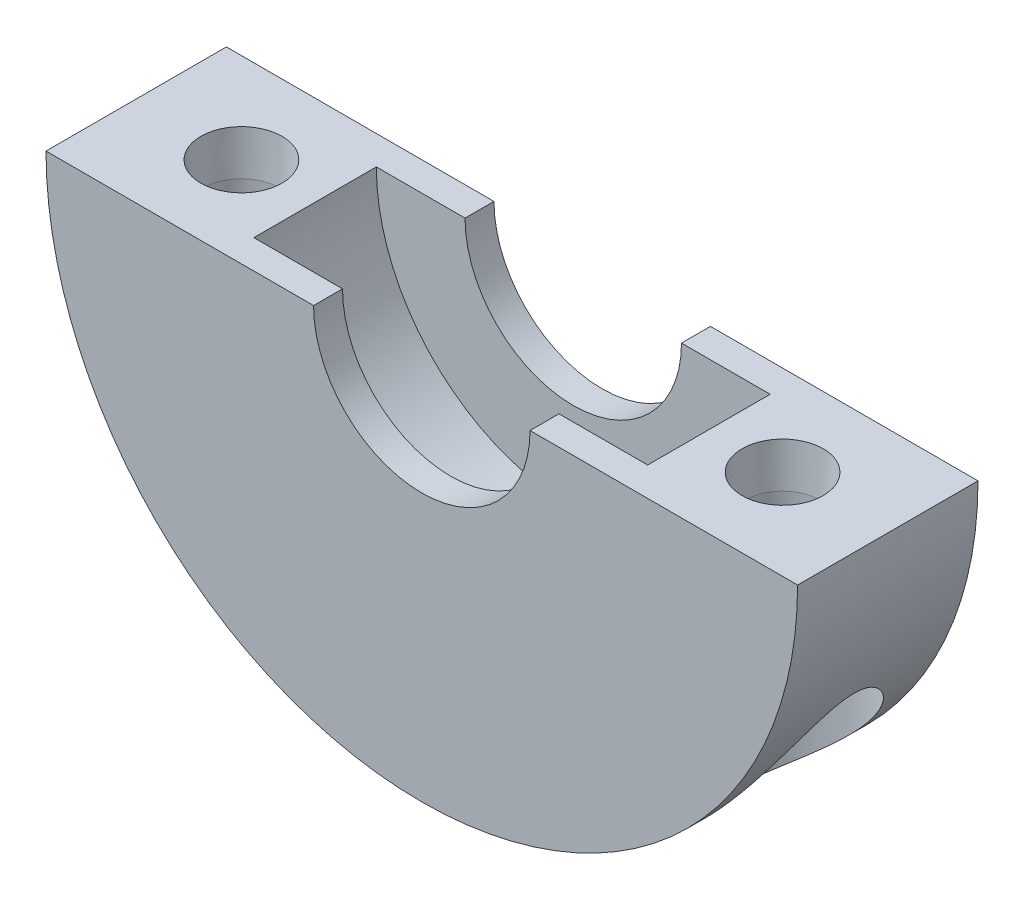
ISO-10303-21;
HEADER;
FILE_DESCRIPTION(('STEP AP214'),'2;1');
FILE_NAME('part.step','',(''),(''),'','','');
FILE_SCHEMA(('AUTOMOTIVE_DESIGN { 1 0 10303 214 1 1 1 1 }'));
ENDSEC;
DATA;
#1=APPLICATION_CONTEXT('core data for automotive mechanical design processes');
#2=APPLICATION_PROTOCOL_DEFINITION('international standard','automotive_design',2000,#1);
#3=PRODUCT_CONTEXT('',#1,'mechanical');
#4=PRODUCT('Part','Part','',(#3));
#5=PRODUCT_RELATED_PRODUCT_CATEGORY('part','',(#4));
#6=PRODUCT_DEFINITION_FORMATION('','',#4);
#7=PRODUCT_DEFINITION_CONTEXT('part definition',#1,'design');
#8=PRODUCT_DEFINITION('design','',#6,#7);
#9=PRODUCT_DEFINITION_SHAPE('','',#8);
#10=(LENGTH_UNIT() NAMED_UNIT(*) SI_UNIT(.MILLI.,.METRE.));
#11=(NAMED_UNIT(*) PLANE_ANGLE_UNIT() SI_UNIT($,.RADIAN.));
#12=(NAMED_UNIT(*) SI_UNIT($,.STERADIAN.) SOLID_ANGLE_UNIT());
#13=UNCERTAINTY_MEASURE_WITH_UNIT(LENGTH_MEASURE(1.E-05),#10,'distance_accuracy_value','');
#14=(GEOMETRIC_REPRESENTATION_CONTEXT(3) GLOBAL_UNCERTAINTY_ASSIGNED_CONTEXT((#13)) GLOBAL_UNIT_ASSIGNED_CONTEXT((#10,
#11,#12)) REPRESENTATION_CONTEXT('',''));
#15=CARTESIAN_POINT('',(0.,0.,0.));
#16=DIRECTION('',(0.,0.,1.));
#17=DIRECTION('',(1.,0.,0.));
#18=AXIS2_PLACEMENT_3D('',#15,#16,#17);
#19=CARTESIAN_POINT('',(0.,0.,12.));
#20=DIRECTION('',(0.,1.,0.));
#21=DIRECTION('',(-1.,0.,0.));
#22=AXIS2_PLACEMENT_3D('',#19,#20,#21);
#23=PLANE('',#22);
#24=CARTESIAN_POINT('',(18.,0.,6.));
#25=DIRECTION('',(0.,1.,0.));
#26=DIRECTION('',(0.,0.,1.));
#27=AXIS2_PLACEMENT_3D('',#24,#25,#26);
#28=CIRCLE('',#27,2.7);
#29=CARTESIAN_POINT('',(18.,0.,8.7));
#30=VERTEX_POINT('',#29);
#31=EDGE_CURVE('E229',#30,#30,#28,.T.);
#32=ORIENTED_EDGE('',*,*,#31,.F.);
#33=EDGE_LOOP('',(#32));
#34=FACE_BOUND('',#33,.T.);
#35=DIRECTION('',(0.,0.,-1.));
#36=VECTOR('',#35,1.);
#37=CARTESIAN_POINT('',(7.2,0.,0.));
#38=LINE('',#37,#36);
#39=CARTESIAN_POINT('',(7.2,0.,1.925));
#40=VERTEX_POINT('',#39);
#41=CARTESIAN_POINT('',(7.2,0.,0.));
#42=VERTEX_POINT('',#41);
#43=EDGE_CURVE('E51',#40,#42,#38,.T.);
#44=ORIENTED_EDGE('',*,*,#43,.F.);
#45=DIRECTION('',(-1.,0.,0.));
#46=VECTOR('',#45,1.);
#47=CARTESIAN_POINT('',(0.,0.,1.925));
#48=LINE('',#47,#46);
#49=CARTESIAN_POINT('',(13.1,0.,1.925));
#50=VERTEX_POINT('',#49);
#51=EDGE_CURVE('E11',#50,#40,#48,.T.);
#52=ORIENTED_EDGE('',*,*,#51,.F.);
#53=DIRECTION('',(0.,0.,-1.));
#54=VECTOR('',#53,1.);
#55=CARTESIAN_POINT('',(13.1,0.,0.));
#56=LINE('',#55,#54);
#57=CARTESIAN_POINT('',(13.1,0.,10.075));
#58=VERTEX_POINT('',#57);
#59=EDGE_CURVE('E42',#58,#50,#56,.T.);
#60=ORIENTED_EDGE('',*,*,#59,.F.);
#61=DIRECTION('',(-1.,0.,0.));
#62=VECTOR('',#61,1.);
#63=CARTESIAN_POINT('',(0.,0.,10.075));
#64=LINE('',#63,#62);
#65=CARTESIAN_POINT('',(7.2,0.,10.075));
#66=VERTEX_POINT('',#65);
#67=EDGE_CURVE('E212',#58,#66,#64,.T.);
#68=ORIENTED_EDGE('',*,*,#67,.T.);
#69=DIRECTION('',(0.,0.,-1.));
#70=VECTOR('',#69,1.);
#71=CARTESIAN_POINT('',(7.2,0.,0.));
#72=LINE('',#71,#70);
#73=CARTESIAN_POINT('',(7.2,0.,12.));
#74=VERTEX_POINT('',#73);
#75=EDGE_CURVE('E168',#74,#66,#72,.T.);
#76=ORIENTED_EDGE('',*,*,#75,.F.);
#77=DIRECTION('',(1.,0.,0.));
#78=VECTOR('',#77,1.);
#79=CARTESIAN_POINT('',(0.,0.,12.));
#80=LINE('',#79,#78);
#81=CARTESIAN_POINT('',(25.,0.,12.));
#82=VERTEX_POINT('',#81);
#83=EDGE_CURVE('E60',#74,#82,#80,.T.);
#84=ORIENTED_EDGE('',*,*,#83,.T.);
#85=DIRECTION('',(0.,0.,-1.));
#86=VECTOR('',#85,1.);
#87=CARTESIAN_POINT('',(25.,0.,12.));
#88=LINE('',#87,#86);
#89=CARTESIAN_POINT('',(25.,0.,0.));
#90=VERTEX_POINT('',#89);
#91=EDGE_CURVE('E85',#82,#90,#88,.T.);
#92=ORIENTED_EDGE('',*,*,#91,.T.);
#93=DIRECTION('',(1.,0.,0.));
#94=VECTOR('',#93,1.);
#95=CARTESIAN_POINT('',(0.,0.,0.));
#96=LINE('',#95,#94);
#97=EDGE_CURVE('E74',#42,#90,#96,.T.);
#98=ORIENTED_EDGE('',*,*,#97,.F.);
#99=EDGE_LOOP('',(#44,#52,#60,#68,#76,#84,#92,#98));
#100=FACE_BOUND('',#99,.T.);
#101=ADVANCED_FACE('F33',(#34,#100),#23,.T.);
#102=CARTESIAN_POINT('',(0.,0.,12.));
#103=DIRECTION('',(0.,0.,-1.));
#104=DIRECTION('',(-1.,0.,0.));
#105=AXIS2_PLACEMENT_3D('',#102,#103,#104);
#106=CYLINDRICAL_SURFACE('',#105,25.);
#107=CARTESIAN_POINT('',(0.,0.,0.));
#108=DIRECTION('',(0.,0.,1.));
#109=DIRECTION('',(1.,0.,0.));
#110=AXIS2_PLACEMENT_3D('',#107,#108,#109);
#111=CIRCLE('',#110,25.);
#112=CARTESIAN_POINT('',(-25.,0.,0.));
#113=VERTEX_POINT('',#112);
#114=EDGE_CURVE('E78',#113,#90,#111,.T.);
#115=ORIENTED_EDGE('',*,*,#114,.T.);
#116=ORIENTED_EDGE('',*,*,#91,.F.);
#117=CARTESIAN_POINT('',(0.,0.,12.));
#118=DIRECTION('',(0.,0.,1.));
#119=DIRECTION('',(1.,0.,0.));
#120=AXIS2_PLACEMENT_3D('',#117,#118,#119);
#121=CIRCLE('',#120,25.);
#122=CARTESIAN_POINT('',(-25.,0.,12.));
#123=VERTEX_POINT('',#122);
#124=EDGE_CURVE('E89',#123,#82,#121,.T.);
#125=ORIENTED_EDGE('',*,*,#124,.F.);
#126=DIRECTION('',(0.,0.,-1.));
#127=VECTOR('',#126,1.);
#128=CARTESIAN_POINT('',(-25.,0.,12.));
#129=LINE('',#128,#127);
#130=EDGE_CURVE('E88',#123,#113,#129,.T.);
#131=ORIENTED_EDGE('',*,*,#130,.T.);
#132=EDGE_LOOP('',(#115,#116,#125,#131));
#133=FACE_BOUND('',#132,.T.);
#134=CARTESIAN_POINT('',(-13.25,-21.1999410376539,6.));
#135=CARTESIAN_POINT('',(-13.2500009354019,-21.1999406878279,6.11699361126747));
#136=CARTESIAN_POINT('',(-13.254329216846,-21.1972371754924,6.23402318464072));
#137=CARTESIAN_POINT('',(-13.2715892849546,-21.1864347706166,6.46724693337123));
#138=CARTESIAN_POINT('',(-13.2845263192154,-21.1783325872301,6.58344055546743));
#139=CARTESIAN_POINT('',(-13.3188614661342,-21.156756385658,6.81430009601783));
#140=CARTESIAN_POINT('',(-13.3402758904643,-21.1432720109755,6.92896262614904));
#141=CARTESIAN_POINT('',(-13.3912818987238,-21.1110037272912,7.15573854865243));
#142=CARTESIAN_POINT('',(-13.4208767862804,-21.0922176771776,7.26785089130886));
#143=CARTESIAN_POINT('',(-13.4877234802794,-21.0495339680623,7.48831511482083));
#144=CARTESIAN_POINT('',(-13.5249476383107,-21.0256547542797,7.59667896758992));
#145=CARTESIAN_POINT('',(-13.6066522648071,-20.9728724424999,7.80941552965167));
#146=CARTESIAN_POINT('',(-13.6511354506462,-20.9439674628706,7.91378672618618));
#147=CARTESIAN_POINT('',(-13.7467560236759,-20.8813304174432,8.11780463726225));
#148=CARTESIAN_POINT('',(-13.7978875611386,-20.8476025925809,8.21745540125836));
#149=CARTESIAN_POINT('',(-13.9062526325002,-20.7754753346104,8.4116600733157));
#150=CARTESIAN_POINT('',(-13.963488487261,-20.737074123892,8.50621202208845));
#151=CARTESIAN_POINT('',(-14.0857997976982,-20.6541983185497,8.69342275965967));
#152=CARTESIAN_POINT('',(-14.1510963333156,-20.609543082356,8.78585720595197));
#153=CARTESIAN_POINT('',(-14.286863595557,-20.5156612952178,8.96440800309845));
#154=CARTESIAN_POINT('',(-14.3573361722325,-20.4664331081011,9.05052207268236));
#155=CARTESIAN_POINT('',(-14.5754125344253,-20.3122850329553,9.29896746350432));
#156=CARTESIAN_POINT('',(-14.7297410009443,-20.2008573709025,9.45150136157468));
#157=CARTESIAN_POINT('',(-15.0715415792244,-19.947420684545,9.74757458625588));
#158=CARTESIAN_POINT('',(-15.2607078111097,-19.8033178528879,9.8873229239578));
#159=CARTESIAN_POINT('',(-15.6477876780748,-19.4989073588987,10.1330624700875));
#160=CARTESIAN_POINT('',(-15.8457075787858,-19.3385879800196,10.2390290381733));
#161=CARTESIAN_POINT('',(-16.1966937988227,-19.0448500843349,10.3975300670112));
#162=CARTESIAN_POINT('',(-16.3491287740354,-18.9142057815718,10.4567843545121));
#163=CARTESIAN_POINT('',(-16.6540017985108,-18.6463236661506,10.5581351479274));
#164=CARTESIAN_POINT('',(-16.8064398250081,-18.5090832586319,10.6002248386214));
#165=CARTESIAN_POINT('',(-17.1099828528766,-18.2288572510288,10.6684700869027));
#166=CARTESIAN_POINT('',(-17.2610854409109,-18.0858631319094,10.6946010154074));
#167=CARTESIAN_POINT('',(-17.5605725224289,-17.7952201388657,10.7320373061075));
#168=CARTESIAN_POINT('',(-17.7089570101369,-17.6475712550523,10.7433426368035));
#169=CARTESIAN_POINT('',(-18.0544368448399,-17.2950273527785,10.7538547165131));
#170=CARTESIAN_POINT('',(-18.2500402159195,-17.0884881729503,10.7473118971728));
#171=CARTESIAN_POINT('',(-18.6331558278659,-16.6699159608359,10.7115445224366));
#172=CARTESIAN_POINT('',(-18.8206649309713,-16.4578808481199,10.6823112529236));
#173=CARTESIAN_POINT('',(-19.1869419801842,-16.0293753810103,10.6031351371525));
#174=CARTESIAN_POINT('',(-19.3656897090265,-15.812896266367,10.5531467010035));
#175=CARTESIAN_POINT('',(-19.7132970062764,-15.3773714032695,10.4340575810996));
#176=CARTESIAN_POINT('',(-19.8821581255631,-15.1583260638747,10.3649599047324));
#177=CARTESIAN_POINT('',(-20.2138995288947,-14.7131689242193,10.2066405988469));
#178=CARTESIAN_POINT('',(-20.3765032712382,-14.487023525325,10.1169347965738));
#179=CARTESIAN_POINT('',(-20.6904914179785,-14.0349320035801,9.91895748953908));
#180=CARTESIAN_POINT('',(-20.8418718817817,-13.8089859779867,9.81067950771928));
#181=CARTESIAN_POINT('',(-21.1323660699509,-13.3601757561718,9.57569181058597));
#182=CARTESIAN_POINT('',(-21.271522626339,-13.1373033117989,9.44905094313801));
#183=CARTESIAN_POINT('',(-21.5374325046671,-12.6966542030495,9.17576074722187));
#184=CARTESIAN_POINT('',(-21.664196575785,-12.4788732493839,9.02912902792398));
#185=CARTESIAN_POINT('',(-21.8688173008568,-12.1154721798532,8.75940716808045));
#186=CARTESIAN_POINT('',(-21.9500841674756,-11.9674861532958,8.64209836968467));
#187=CARTESIAN_POINT('',(-22.1051545044403,-11.6785694472158,8.39408371559209));
#188=CARTESIAN_POINT('',(-22.1789509259205,-11.5376454933773,8.26336543698906));
#189=CARTESIAN_POINT('',(-22.3181462314386,-11.2660459974773,7.98508632160629));
#190=CARTESIAN_POINT('',(-22.3834736873633,-11.135460841697,7.83739984270066));
#191=CARTESIAN_POINT('',(-22.5023927019266,-10.8931341922735,7.52286486122829));
#192=CARTESIAN_POINT('',(-22.5560117611926,-10.781348687322,7.35606269518182));
#193=CARTESIAN_POINT('',(-22.6292542178805,-10.6264377545541,7.07004939623825));
#194=CARTESIAN_POINT('',(-22.6539915572203,-10.5735111764626,6.95753061390808));
#195=CARTESIAN_POINT('',(-22.6958294089708,-10.4834054626948,6.72498179192325));
#196=CARTESIAN_POINT('',(-22.7129400398013,-10.446205465827,6.60496194663774));
#197=CARTESIAN_POINT('',(-22.7381202171049,-10.3912877297424,6.35808565193586));
#198=CARTESIAN_POINT('',(-22.7460908824269,-10.3737831032211,6.23116970914938));
#199=CARTESIAN_POINT('',(-22.7516494744591,-10.3615881835076,5.976021373475));
#200=CARTESIAN_POINT('',(-22.7492426685988,-10.3668863160167,5.84778968140732));
#201=CARTESIAN_POINT('',(-22.7352571717261,-10.3975132949949,5.60956631487095));
#202=CARTESIAN_POINT('',(-22.7247736096511,-10.4204498995295,5.49918287150956));
#203=CARTESIAN_POINT('',(-22.6969067432075,-10.4810082773915,5.28346781198287));
#204=CARTESIAN_POINT('',(-22.6795181422513,-10.5186413234212,5.17814014358652));
#205=CARTESIAN_POINT('',(-22.6266976195214,-10.6319517987696,4.91179418122354));
#206=CARTESIAN_POINT('',(-22.586714877977,-10.7168696281492,4.75565299910817));
#207=CARTESIAN_POINT('',(-22.4958510281896,-10.9063181932321,4.45920831247828));
#208=CARTESIAN_POINT('',(-22.4449336004843,-11.0109141425141,4.31896002739254));
#209=CARTESIAN_POINT('',(-22.3379021453648,-11.2263893322185,4.06000868374535));
#210=CARTESIAN_POINT('',(-22.282239921856,-11.336586850286,3.94053831449832));
#211=CARTESIAN_POINT('',(-22.1647633773839,-11.564589926391,3.71226313024808));
#212=CARTESIAN_POINT('',(-22.1029435594737,-11.6824022487046,3.60346802026611));
#213=CARTESIAN_POINT('',(-21.9738724977856,-11.9234081879797,3.39502796761796));
#214=CARTESIAN_POINT('',(-21.906611610977,-12.0466111730844,3.29539997008017));
#215=CARTESIAN_POINT('',(-21.767233703556,-12.2966678883586,3.10441270248893));
#216=CARTESIAN_POINT('',(-21.6951150790548,-12.4235228163029,3.01305618701664));
#217=CARTESIAN_POINT('',(-21.5534974873549,-12.6674658341735,2.84628111571731));
#218=CARTESIAN_POINT('',(-21.4844100638528,-12.7843245427717,2.77017422865398));
#219=CARTESIAN_POINT('',(-21.3427048986731,-13.019516721512,2.62373000395637));
#220=CARTESIAN_POINT('',(-21.2700866799992,-13.1378503893005,2.5533934493394));
#221=CARTESIAN_POINT('',(-21.0470426240449,-13.4944634565356,2.35054789029208));
#222=CARTESIAN_POINT('',(-20.8914791694907,-13.734265286629,2.22626326769473));
#223=CARTESIAN_POINT('',(-20.5671451956764,-14.2153763251394,1.99855699105954));
#224=CARTESIAN_POINT('',(-20.3983547453717,-14.4566872838532,1.89516769581605));
#225=CARTESIAN_POINT('',(-20.0482833214578,-14.9383712993096,1.70974982024675));
#226=CARTESIAN_POINT('',(-19.8670058443466,-15.1787445988474,1.62771529086287));
#227=CARTESIAN_POINT('',(-19.4877702564626,-15.6628126904491,1.48434330428315));
#228=CARTESIAN_POINT('',(-19.2895076325066,-15.906439372965,1.42357714371428));
#229=CARTESIAN_POINT('',(-18.8811865912738,-16.3890417731589,1.3277425944479));
#230=CARTESIAN_POINT('',(-18.6711244495453,-16.6280159898957,1.29268236931628));
#231=CARTESIAN_POINT('',(-18.241438851167,-17.0982745243457,1.25124927359453));
#232=CARTESIAN_POINT('',(-18.0218528338888,-17.329583588021,1.24477282266115));
#233=CARTESIAN_POINT('',(-17.5747000244676,-17.7828846398276,1.26379785662965));
#234=CARTESIAN_POINT('',(-17.3471407948291,-18.0048850402892,1.28926979643284));
#235=CARTESIAN_POINT('',(-16.9876684565419,-18.3425982408364,1.35725329164989));
#236=CARTESIAN_POINT('',(-16.8572780361854,-18.4624796671354,1.38750633743316));
#237=CARTESIAN_POINT('',(-16.595902553966,-18.6977774422552,1.46024197795689));
#238=CARTESIAN_POINT('',(-16.464917692399,-18.8131951859776,1.50272071655763));
#239=CARTESIAN_POINT('',(-16.2034977619288,-19.0388144265724,1.60062011099519));
#240=CARTESIAN_POINT('',(-16.0730622953568,-19.1490206690221,1.65602870896698));
#241=CARTESIAN_POINT('',(-15.8138988435529,-19.3635968651238,1.78050754493232));
#242=CARTESIAN_POINT('',(-15.6851706198249,-19.4679676406634,1.8495758527957));
#243=CARTESIAN_POINT('',(-15.4530593376354,-19.6525055553983,1.98869304451981));
#244=CARTESIAN_POINT('',(-15.3491597430166,-19.733726596979,2.05648515510098));
#245=CARTESIAN_POINT('',(-15.1445804525924,-19.8911621585377,2.20199671411209));
#246=CARTESIAN_POINT('',(-15.043900101826,-19.9673777002627,2.27971412694442));
#247=CARTESIAN_POINT('',(-14.8468152062052,-20.1143530305677,2.44521607458763));
#248=CARTESIAN_POINT('',(-14.7504122945434,-20.1851107427496,2.53300440953557));
#249=CARTESIAN_POINT('',(-14.5631840110677,-20.32060578758,2.71851386169925));
#250=CARTESIAN_POINT('',(-14.4723557564243,-20.3853462410043,2.81622977443443));
#251=CARTESIAN_POINT('',(-14.2967062686355,-20.5089207315197,3.02231443341052));
#252=CARTESIAN_POINT('',(-14.2119477398346,-20.5676951791753,3.13077262888041));
#253=CARTESIAN_POINT('',(-14.0507681614034,-20.6781396395015,3.35701957524692));
#254=CARTESIAN_POINT('',(-13.9743427599072,-20.7298133641367,3.47480339993978));
#255=CARTESIAN_POINT('',(-13.8311392864606,-20.8256335491979,3.71896361483323));
#256=CARTESIAN_POINT('',(-13.7643592430729,-20.8697815481579,3.8453382413519));
#257=CARTESIAN_POINT('',(-13.641715397521,-20.9501547597748,4.10565608725514));
#258=CARTESIAN_POINT('',(-13.585847969124,-20.9863826047564,4.23959677331967));
#259=CARTESIAN_POINT('',(-13.4975571729755,-21.0432420901423,4.48237904920694));
#260=CARTESIAN_POINT('',(-13.4626944204873,-21.0655456404271,4.5899518014429));
#261=CARTESIAN_POINT('',(-13.4005561960702,-21.1051286050147,4.80816220820095));
#262=CARTESIAN_POINT('',(-13.3732793932162,-21.1224089006519,4.91879932134281));
#263=CARTESIAN_POINT('',(-13.3267216901485,-21.1518142400603,5.1421235243731));
#264=CARTESIAN_POINT('',(-13.3074212971357,-21.1639518534044,5.25480490576434));
#265=CARTESIAN_POINT('',(-13.2769817790156,-21.1830611827573,5.48165460069746));
#266=CARTESIAN_POINT('',(-13.2658381667204,-21.190035739078,5.59582206148387));
#267=CARTESIAN_POINT('',(-13.2558965262563,-21.1962547553955,5.75850957231967));
#268=CARTESIAN_POINT('',(-13.2536861937864,-21.1976367881579,5.80676667225135));
#269=CARTESIAN_POINT('',(-13.2507376786771,-21.1994800383067,5.9033471325171));
#270=CARTESIAN_POINT('',(-13.2499996135899,-21.1999411821653,5.95167049783386));
#271=CARTESIAN_POINT('',(-13.25,-21.1999410376539,6.));
#272=B_SPLINE_CURVE_WITH_KNOTS('',3,(#134,#135,#136,#137,#138,#139,#140,#141,#142,#143,#144,
#145,#146,#147,#148,#149,#150,#151,#152,#153,#154,#155,#156,#157,#158,#159,#160,#161,#162,#163,
#164,#165,#166,#167,#168,#169,#170,#171,#172,#173,#174,#175,#176,#177,#178,#179,#180,#181,#182,
#183,#184,#185,#186,#187,#188,#189,#190,#191,#192,#193,#194,#195,#196,#197,#198,#199,#200,#201,
#202,#203,#204,#205,#206,#207,#208,#209,#210,#211,#212,#213,#214,#215,#216,#217,#218,#219,#220,
#221,#222,#223,#224,#225,#226,#227,#228,#229,#230,#231,#232,#233,#234,#235,#236,#237,#238,#239,
#240,#241,#242,#243,#244,#245,#246,#247,#248,#249,#250,#251,#252,#253,#254,#255,#256,#257,#258,
#259,#260,#261,#262,#263,#264,#265,#266,#267,#268,#269,#270,#271),.UNSPECIFIED.,.T.,.F.,(4,2,2,
2,2,2,2,2,2,2,2,2,2,2,2,2,2,2,2,2,2,2,2,2,2,2,2,2,2,2,2,2,2,2,2,2,2,2,2,2,2,2,2,2,2,2,2,2,2,2,2,
2,2,2,2,2,2,2,2,2,2,2,2,2,2,2,2,2,4),(0.,0.350932395108258,0.702078902587325,1.05390437442424,
1.40587213681482,1.756586236082,2.10743192553503,2.45797097709546,2.80864378197495,
3.17324432714769,3.53797583021591,4.2670608987449,5.09158260882387,5.91670435432483,
6.54386243070996,7.17126927896304,7.79964197044317,8.42801599700388,9.28039302255181,
10.1330975599203,10.9876851036359,11.8421382299215,12.7192038399887,13.5965759514331,
14.4707397438035,15.3441384351196,15.9603638767177,16.5771654522522,17.1988708305209,
17.8190998566371,18.1983272543907,18.5770500193446,18.9598324669248,19.3424206434634,
19.6806756079479,20.0191905374485,20.5625889642787,21.1078209979625,21.6224641739728,
22.1375709664219,22.6536115540613,23.1698233670147,23.6365531452379,24.103346152933,
25.0372903508475,25.9726699684845,26.9077887264485,27.8663833945075,28.8252823566938,
29.7807036442648,30.7352420324393,31.2739148938159,31.8124180367426,32.3504209862222,
32.8883479696116,33.3327823504932,33.7771257274901,34.2216373268752,34.6659170842167,
35.1142698625594,35.5623873616356,36.0104131389237,36.4582897842191,36.8036948407531,
37.1490392590394,37.4935346595156,37.8378404043218,37.9827973275033,38.1277658242084),.UNSPECIFIED.);
#273=CARTESIAN_POINT('',(-13.25,-21.1999410376539,6.));
#274=VERTEX_POINT('',#273);
#275=EDGE_CURVE('E99',#274,#274,#272,.T.);
#276=ORIENTED_EDGE('',*,*,#275,.F.);
#277=EDGE_LOOP('',(#276));
#278=FACE_BOUND('',#277,.T.);
#279=CARTESIAN_POINT('',(22.75,-10.3652062208139,6.));
#280=CARTESIAN_POINT('',(22.7499961113231,-10.3652157460256,6.12468859413371));
#281=CARTESIAN_POINT('',(22.7450330329192,-10.3761286580684,6.24940715359003));
#282=CARTESIAN_POINT('',(22.7257835312809,-10.4182177096908,6.49465860071015));
#283=CARTESIAN_POINT('',(22.7114822906056,-10.4494260529703,6.61518451496497));
#284=CARTESIAN_POINT('',(22.669619292818,-10.5399941061508,6.8835296586202));
#285=CARTESIAN_POINT('',(22.6394015168304,-10.6049197975806,7.02901267415249));
#286=CARTESIAN_POINT('',(22.5689118041685,-10.7541159158818,7.30700239678459));
#287=CARTESIAN_POINT('',(22.528615000358,-10.8384341462995,7.43947586371124));
#288=CARTESIAN_POINT('',(22.4452692630456,-11.0099033503599,7.6781561258962));
#289=CARTESIAN_POINT('',(22.4030242396947,-11.0956974544844,7.78564579522137));
#290=CARTESIAN_POINT('',(22.3135161196162,-11.2746181075511,7.99217423809719));
#291=CARTESIAN_POINT('',(22.2662489442565,-11.3677506001002,8.09120602320398));
#292=CARTESIAN_POINT('',(22.1673478455518,-11.5594270808454,8.28194446724592));
#293=CARTESIAN_POINT('',(22.1157051700238,-11.6579817700007,8.37363569536278));
#294=CARTESIAN_POINT('',(22.0085965668554,-11.8589482219823,8.550358749749));
#295=CARTESIAN_POINT('',(21.9531292633295,-11.9613613667899,8.63538815572337));
#296=CARTESIAN_POINT('',(21.8401222619028,-12.1664468490836,8.79740457240781));
#297=CARTESIAN_POINT('',(21.7826673047989,-12.2690506207323,8.87453812479589));
#298=CARTESIAN_POINT('',(21.6646459844125,-12.4762715221856,9.02355688726718));
#299=CARTESIAN_POINT('',(21.6040790877577,-12.5808889951948,9.09544119250685));
#300=CARTESIAN_POINT('',(21.4178673005493,-12.8970820954551,9.30385735251405));
#301=CARTESIAN_POINT('',(21.2877670724562,-13.1108966732022,9.43307376186886));
#302=CARTESIAN_POINT('',(21.0163447394845,-13.5417227886593,9.67383655169166));
#303=CARTESIAN_POINT('',(20.8750075381726,-13.7587382968788,9.7853585370178));
#304=CARTESIAN_POINT('',(20.5817431330251,-14.1936824175262,9.99113631105808));
#305=CARTESIAN_POINT('',(20.4298192171709,-14.4116107268705,10.0853974278825));
#306=CARTESIAN_POINT('',(20.1055296484165,-14.8610009538046,10.2621018740825));
#307=CARTESIAN_POINT('',(19.9324773302149,-15.0924252382498,10.3433843870892));
#308=CARTESIAN_POINT('',(19.5751701882688,-15.5530603600922,10.4853419586707));
#309=CARTESIAN_POINT('',(19.3909127760451,-15.7822706717612,10.5460122341459));
#310=CARTESIAN_POINT('',(19.0122915633935,-16.2363785316114,10.644994732471));
#311=CARTESIAN_POINT('',(18.8179490823113,-16.4612839038772,10.6833521819225));
#312=CARTESIAN_POINT('',(18.4198875893481,-16.9055187615565,10.7356584031932));
#313=CARTESIAN_POINT('',(18.2161730421305,-17.1248508262395,10.7496186762588));
#314=CARTESIAN_POINT('',(17.8658487803355,-17.488678082969,10.7502491031801));
#315=CARTESIAN_POINT('',(17.7212802449799,-17.635147351509,10.744082111938));
#316=CARTESIAN_POINT('',(17.4292235925413,-17.9238470097372,10.7178604091131));
#317=CARTESIAN_POINT('',(17.2817362222447,-18.066078460926,10.6978092063131));
#318=CARTESIAN_POINT('',(16.9848952735841,-18.3454302416287,10.6427172058519));
#319=CARTESIAN_POINT('',(16.8355432069368,-18.4825543926591,10.6076878708381));
#320=CARTESIAN_POINT('',(16.5362122526755,-18.7508437535575,10.5215142099884));
#321=CARTESIAN_POINT('',(16.3862335085521,-18.8820102537918,10.4703733929621));
#322=CARTESIAN_POINT('',(15.9999475863977,-19.2119274999024,10.3159274634747));
#323=CARTESIAN_POINT('',(15.7642348562063,-19.4055481345034,10.1995883800047));
#324=CARTESIAN_POINT('',(15.3038755033557,-19.7706247106368,9.91992298684296));
#325=CARTESIAN_POINT('',(15.0792159080971,-19.9421070385608,9.75665337654332));
#326=CARTESIAN_POINT('',(14.6889605437399,-20.2307409347821,9.41389955706697));
#327=CARTESIAN_POINT('',(14.519863994807,-20.3521611777091,9.2420812738994));
#328=CARTESIAN_POINT('',(14.2834419275701,-20.5181051804719,8.96053736174411));
#329=CARTESIAN_POINT('',(14.2074754852497,-20.5707416586088,8.86267180312228));
#330=CARTESIAN_POINT('',(14.0622545264122,-20.6702860333511,8.65936821191464));
#331=CARTESIAN_POINT('',(13.9929971399149,-20.7171963817171,8.55393345116695));
#332=CARTESIAN_POINT('',(13.8617215825189,-20.8052631470334,8.33527851945653));
#333=CARTESIAN_POINT('',(13.7997551117892,-20.8463788377087,8.22201085020829));
#334=CARTESIAN_POINT('',(13.6845826190075,-20.9221641043629,7.98910493119963));
#335=CARTESIAN_POINT('',(13.6313724752709,-20.9568367141587,7.86946971400272));
#336=CARTESIAN_POINT('',(13.534556932593,-21.0194932755625,7.62469639156626));
#337=CARTESIAN_POINT('',(13.4909504333401,-21.0474779934489,7.49955891870564));
#338=CARTESIAN_POINT('',(13.4140889753694,-21.096547139644,7.24483388194905));
#339=CARTESIAN_POINT('',(13.3808327605349,-21.1176324052901,7.11524686017404));
#340=CARTESIAN_POINT('',(13.3283430185731,-21.1507948575861,6.86737894932452));
#341=CARTESIAN_POINT('',(13.3079633730992,-21.1636117257402,6.7494380134081));
#342=CARTESIAN_POINT('',(13.2761424791783,-21.1835878988119,6.51188565617463));
#343=CARTESIAN_POINT('',(13.2647005312778,-21.1907476464496,6.39227436632337));
#344=CARTESIAN_POINT('',(13.2509246136524,-21.1993646814688,6.15236644140629));
#345=CARTESIAN_POINT('',(13.2485874832904,-21.2008239477101,6.03207005868811));
#346=CARTESIAN_POINT('',(13.2530469870083,-21.1980365370323,5.79171341472768));
#347=CARTESIAN_POINT('',(13.2598434384812,-21.1937899741894,5.67165314881281));
#348=CARTESIAN_POINT('',(13.281851001196,-21.1800044884401,5.43924706122729));
#349=CARTESIAN_POINT('',(13.2965831298665,-21.1707667360036,5.32683752667624));
#350=CARTESIAN_POINT('',(13.3339342757262,-21.1472618418089,5.1038327074398));
#351=CARTESIAN_POINT('',(13.3565558433032,-21.1329930736776,4.99323802155299));
#352=CARTESIAN_POINT('',(13.4093836368354,-21.0995119895979,4.77469425588132));
#353=CARTESIAN_POINT('',(13.439586567758,-21.0803018212047,4.66674404905983));
#354=CARTESIAN_POINT('',(13.5072155417599,-21.0370325682366,4.45408802265651));
#355=CARTESIAN_POINT('',(13.5446442943239,-21.0129716646187,4.3493834372396));
#356=CARTESIAN_POINT('',(13.6269680287644,-20.9596799591979,4.14211625315414));
#357=CARTESIAN_POINT('',(13.6719797274932,-20.9303677956039,4.03962088883338));
#358=CARTESIAN_POINT('',(13.7684632729102,-20.8670255196067,3.83921617032169));
#359=CARTESIAN_POINT('',(13.8199374450115,-20.8329937084537,3.74130848443281));
#360=CARTESIAN_POINT('',(13.9831668626636,-20.7240950927507,3.45527252549898));
#361=CARTESIAN_POINT('',(14.1037932819421,-20.6423840924633,3.2746722200117));
#362=CARTESIAN_POINT('',(14.3741640685141,-20.455135348122,2.92281159385359));
#363=CARTESIAN_POINT('',(14.5254849620801,-20.3481932955078,2.75353128547183));
#364=CARTESIAN_POINT('',(14.8436120409157,-20.1172999198721,2.44344545567753));
#365=CARTESIAN_POINT('',(15.0104272588333,-19.9933386548583,2.30265669778242));
#366=CARTESIAN_POINT('',(15.3028382986107,-19.7698344953885,2.08715253070901));
#367=CARTESIAN_POINT('',(15.4260095024463,-19.6739331590717,2.00521772616728));
#368=CARTESIAN_POINT('',(15.6755527629793,-19.4756878433677,1.8550459294707));
#369=CARTESIAN_POINT('',(15.8019257945722,-19.3733418872785,1.78681316717087));
#370=CARTESIAN_POINT('',(16.0565224774947,-19.1628654217924,1.66347634998524));
#371=CARTESIAN_POINT('',(16.1847483259081,-19.0547275478576,1.60838952013243));
#372=CARTESIAN_POINT('',(16.4416969452081,-18.8334641347977,1.51078121147726));
#373=CARTESIAN_POINT('',(16.5704198339032,-18.720337337349,1.46826292382832));
#374=CARTESIAN_POINT('',(16.870464689552,-18.4510302517346,1.3828060602247));
#375=CARTESIAN_POINT('',(17.0415853912011,-18.2931422321317,1.34451502758321));
#376=CARTESIAN_POINT('',(17.3810118914415,-17.9709556658643,1.28735812223917));
#377=CARTESIAN_POINT('',(17.5493167617366,-17.80665506242,1.26849853603462));
#378=CARTESIAN_POINT('',(17.8819002095811,-17.4726428897426,1.24854380820775));
#379=CARTESIAN_POINT('',(18.0461739107835,-17.3029252883659,1.24746921555126));
#380=CARTESIAN_POINT('',(18.3694839354265,-16.9592968174444,1.26162837451465));
#381=CARTESIAN_POINT('',(18.5285202516754,-16.7853859421421,1.27686214852766));
#382=CARTESIAN_POINT('',(18.8919238666091,-16.376584363831,1.32978762103923));
#383=CARTESIAN_POINT('',(19.094032961033,-16.1404176130651,1.37321019678318));
#384=CARTESIAN_POINT('',(19.4867097544129,-15.6640835084635,1.48404584647132));
#385=CARTESIAN_POINT('',(19.6772726100931,-15.4239145289474,1.55146890742965));
#386=CARTESIAN_POINT('',(20.0463423993795,-14.9411049963189,1.70869749269407));
#387=CARTESIAN_POINT('',(20.2248318304353,-14.6984614180064,1.7985346621909));
#388=CARTESIAN_POINT('',(20.5688797306513,-14.2130085746329,1.99961618768152));
#389=CARTESIAN_POINT('',(20.7344432003106,-13.970199410668,2.11085220711101));
#390=CARTESIAN_POINT('',(21.0062015023448,-13.5566154836807,2.31957896521639));
#391=CARTESIAN_POINT('',(21.1157193998091,-13.3853145591075,2.4117425826137));
#392=CARTESIAN_POINT('',(21.3277183504516,-13.0448687918161,2.6074186446321));
#393=CARTESIAN_POINT('',(21.4302007477879,-12.8757235423054,2.71092891156605));
#394=CARTESIAN_POINT('',(21.6273793129173,-12.5416878105748,2.92978151186665));
#395=CARTESIAN_POINT('',(21.7221036443214,-12.3767835790667,3.04507728821861));
#396=CARTESIAN_POINT('',(21.9035235589544,-12.0528019931473,3.28925331348785));
#397=CARTESIAN_POINT('',(21.9902247985181,-11.8937205821786,3.41812385291034));
#398=CARTESIAN_POINT('',(22.1429612219189,-11.6065451528839,3.67251854293552));
#399=CARTESIAN_POINT('',(22.2101868018197,-11.4772439143102,3.79595411368462));
#400=CARTESIAN_POINT('',(22.3369058766383,-11.2286261094052,4.05709435985574));
#401=CARTESIAN_POINT('',(22.3963815830507,-11.1093327302273,4.1948306028833));
#402=CARTESIAN_POINT('',(22.478388046871,-10.9419405540603,4.41483053284862));
#403=CARTESIAN_POINT('',(22.5046930940028,-10.887702850716,4.49102459808801));
#404=CARTESIAN_POINT('',(22.5542692426493,-10.784627737974,4.64799630560681));
#405=CARTESIAN_POINT('',(22.5775395915597,-10.7357916686342,4.72877507779055));
#406=CARTESIAN_POINT('',(22.6204014394045,-10.6451841406533,4.89469783482863));
#407=CARTESIAN_POINT('',(22.6400086193005,-10.6033826491193,4.97982112988131));
#408=CARTESIAN_POINT('',(22.6749994703381,-10.5283480381961,5.15453573757828));
#409=CARTESIAN_POINT('',(22.6903874064556,-10.4951062683924,5.24412242935853));
#410=CARTESIAN_POINT('',(22.7184119484684,-10.4343221447026,5.44259031630026));
#411=CARTESIAN_POINT('',(22.7301597689753,-10.4086590117465,5.55219499598806));
#412=CARTESIAN_POINT('',(22.7459521221997,-10.3741042124672,5.77452686483087));
#413=CARTESIAN_POINT('',(22.7500035163098,-10.3651976077057,5.88725118175498));
#414=CARTESIAN_POINT('',(22.75,-10.3652062208139,6.));
#415=B_SPLINE_CURVE_WITH_KNOTS('',3,(#279,#280,#281,#282,#283,#284,#285,#286,#287,#288,#289,
#290,#291,#292,#293,#294,#295,#296,#297,#298,#299,#300,#301,#302,#303,#304,#305,#306,#307,#308,
#309,#310,#311,#312,#313,#314,#315,#316,#317,#318,#319,#320,#321,#322,#323,#324,#325,#326,#327,
#328,#329,#330,#331,#332,#333,#334,#335,#336,#337,#338,#339,#340,#341,#342,#343,#344,#345,#346,
#347,#348,#349,#350,#351,#352,#353,#354,#355,#356,#357,#358,#359,#360,#361,#362,#363,#364,#365,
#366,#367,#368,#369,#370,#371,#372,#373,#374,#375,#376,#377,#378,#379,#380,#381,#382,#383,#384,
#385,#386,#387,#388,#389,#390,#391,#392,#393,#394,#395,#396,#397,#398,#399,#400,#401,#402,#403,
#404,#405,#406,#407,#408,#409,#410,#411,#412,#413,#414),.UNSPECIFIED.,.T.,.F.,(4,2,2,2,2,2,2,2,
2,2,2,2,2,2,2,2,2,2,2,2,2,2,2,2,2,2,2,2,2,2,2,2,2,2,2,2,2,2,2,2,2,2,2,2,2,2,2,2,2,2,2,2,2,2,2,2,
2,2,2,2,2,2,2,2,2,2,2,4),(0.,0.373589983631673,0.747774210939525,1.23147451189708,
1.7163801853103,2.14738150316458,2.57873556431251,3.01097379686985,3.44336834388236,
3.86510858509811,4.28692135338228,5.1309660246572,5.97616444632173,6.82110152947539,
7.72076302412634,8.62063314416497,9.51867287446036,10.4162891391491,11.0334969860517,
11.6505489106452,12.2671294530351,12.8835758072786,13.8590466118246,14.8333438137153,
15.6394322101788,16.0428305526569,16.4460555614016,16.8519865446787,17.2577259025069,
17.663418749635,18.0690623424241,18.4297191973231,18.7903478248138,19.1508512528861,
19.5113474735483,19.8521889149411,20.1931406410907,20.5339444376848,20.8748762754329,
21.2216374343709,21.5685237290752,22.2617728288881,23.0118643880121,23.7623960020683,
24.2906414779621,24.8190497747299,25.3481466860313,25.8773778199034,26.5842164675273,
27.2912837211791,27.9991678707032,28.7070529922294,29.6473282946031,30.5879953199395,
31.5299980095654,32.4716344542518,33.1409710519078,33.8101794124047,34.4768394530536,
35.1430258547982,35.7153133859071,36.2888921953135,36.5801188919585,36.8714176759475,
37.1614393954315,37.4511668597314,37.7892846516237,38.1271008685382),.UNSPECIFIED.);
#416=CARTESIAN_POINT('',(22.75,-10.3652062208139,6.));
#417=VERTEX_POINT('',#416);
#418=EDGE_CURVE('E82',#417,#417,#415,.T.);
#419=ORIENTED_EDGE('',*,*,#418,.F.);
#420=EDGE_LOOP('',(#419));
#421=FACE_BOUND('',#420,.T.);
#422=ADVANCED_FACE('F91',(#133,#278,#421),#106,.T.);
#423=CARTESIAN_POINT('',(-18.,0.,6.));
#424=DIRECTION('',(0.,1.,0.));
#425=DIRECTION('',(0.,0.,1.));
#426=AXIS2_PLACEMENT_3D('',#423,#424,#425);
#427=CIRCLE('',#426,2.7);
#428=CARTESIAN_POINT('',(-18.,0.,8.7));
#429=VERTEX_POINT('',#428);
#430=EDGE_CURVE('E145',#429,#429,#427,.T.);
#431=ORIENTED_EDGE('',*,*,#430,.F.);
#432=EDGE_LOOP('',(#431));
#433=FACE_BOUND('',#432,.T.);
#434=DIRECTION('',(0.,0.,-1.));
#435=VECTOR('',#434,1.);
#436=CARTESIAN_POINT('',(-7.2,0.,0.));
#437=LINE('',#436,#435);
#438=CARTESIAN_POINT('',(-7.2,0.,0.));
#439=VERTEX_POINT('',#438);
#440=CARTESIAN_POINT('',(-7.2,0.,1.925));
#441=VERTEX_POINT('',#440);
#442=EDGE_CURVE('E150',#439,#441,#437,.F.);
#443=ORIENTED_EDGE('',*,*,#442,.F.);
#444=EDGE_CURVE('E81',#113,#439,#96,.T.);
#445=ORIENTED_EDGE('',*,*,#444,.F.);
#446=ORIENTED_EDGE('',*,*,#130,.F.);
#447=CARTESIAN_POINT('',(-7.2,0.,12.));
#448=VERTEX_POINT('',#447);
#449=EDGE_CURVE('E94',#123,#448,#80,.T.);
#450=ORIENTED_EDGE('',*,*,#449,.T.);
#451=DIRECTION('',(0.,0.,-1.));
#452=VECTOR('',#451,1.);
#453=CARTESIAN_POINT('',(-7.2,0.,0.));
#454=LINE('',#453,#452);
#455=CARTESIAN_POINT('',(-7.2,0.,10.075));
#456=VERTEX_POINT('',#455);
#457=EDGE_CURVE('E160',#456,#448,#454,.F.);
#458=ORIENTED_EDGE('',*,*,#457,.F.);
#459=CARTESIAN_POINT('',(-13.1,0.,10.075));
#460=VERTEX_POINT('',#459);
#461=EDGE_CURVE('E403',#456,#460,#64,.T.);
#462=ORIENTED_EDGE('',*,*,#461,.T.);
#463=DIRECTION('',(0.,0.,-1.));
#464=VECTOR('',#463,1.);
#465=CARTESIAN_POINT('',(-13.1,0.,0.));
#466=LINE('',#465,#464);
#467=CARTESIAN_POINT('',(-13.1,0.,1.925));
#468=VERTEX_POINT('',#467);
#469=EDGE_CURVE('E404',#468,#460,#466,.F.);
#470=ORIENTED_EDGE('',*,*,#469,.F.);
#471=EDGE_CURVE('E44',#441,#468,#48,.T.);
#472=ORIENTED_EDGE('',*,*,#471,.F.);
#473=EDGE_LOOP('',(#443,#445,#446,#450,#458,#462,#470,#472));
#474=FACE_BOUND('',#473,.T.);
#475=ADVANCED_FACE('F35',(#433,#474),#23,.T.);
#476=CARTESIAN_POINT('',(0.,0.,12.));
#477=DIRECTION('',(0.,0.,1.));
#478=DIRECTION('',(1.,0.,0.));
#479=AXIS2_PLACEMENT_3D('',#476,#477,#478);
#480=PLANE('',#479);
#481=CARTESIAN_POINT('',(0.,0.,12.));
#482=DIRECTION('',(0.,0.,1.));
#483=DIRECTION('',(1.,0.,0.));
#484=AXIS2_PLACEMENT_3D('',#481,#482,#483);
#485=CIRCLE('',#484,7.2);
#486=EDGE_CURVE('E180',#448,#74,#485,.T.);
#487=ORIENTED_EDGE('',*,*,#486,.F.);
#488=ORIENTED_EDGE('',*,*,#449,.F.);
#489=ORIENTED_EDGE('',*,*,#124,.T.);
#490=ORIENTED_EDGE('',*,*,#83,.F.);
#491=EDGE_LOOP('',(#487,#488,#489,#490));
#492=FACE_BOUND('',#491,.T.);
#493=ADVANCED_FACE('F126',(#492),#480,.T.);
#494=CARTESIAN_POINT('',(0.,0.,0.));
#495=DIRECTION('',(0.,0.,1.));
#496=DIRECTION('',(1.,0.,0.));
#497=AXIS2_PLACEMENT_3D('',#494,#495,#496);
#498=PLANE('',#497);
#499=ORIENTED_EDGE('',*,*,#444,.T.);
#500=CARTESIAN_POINT('',(0.,0.,0.));
#501=DIRECTION('',(0.,0.,1.));
#502=DIRECTION('',(1.,0.,0.));
#503=AXIS2_PLACEMENT_3D('',#500,#501,#502);
#504=CIRCLE('',#503,7.2);
#505=EDGE_CURVE('E80',#439,#42,#504,.T.);
#506=ORIENTED_EDGE('',*,*,#505,.T.);
#507=ORIENTED_EDGE('',*,*,#97,.T.);
#508=ORIENTED_EDGE('',*,*,#114,.F.);
#509=EDGE_LOOP('',(#499,#506,#507,#508));
#510=FACE_BOUND('',#509,.T.);
#511=ADVANCED_FACE('F76',(#510),#498,.F.);
#512=CARTESIAN_POINT('',(-18.,-5.,6.));
#513=DIRECTION('',(0.,-1.,0.));
#514=DIRECTION('',(1.,0.,0.));
#515=AXIS2_PLACEMENT_3D('',#512,#513,#514);
#516=CYLINDRICAL_SURFACE('',#515,4.75);
#517=CARTESIAN_POINT('',(-18.,-5.,6.));
#518=DIRECTION('',(0.,1.,0.));
#519=DIRECTION('',(-1.,0.,0.));
#520=AXIS2_PLACEMENT_3D('',#517,#518,#519);
#521=CIRCLE('',#520,4.75);
#522=CARTESIAN_POINT('',(-22.75,-5.,6.));
#523=VERTEX_POINT('',#522);
#524=EDGE_CURVE('E171',#523,#523,#521,.T.);
#525=ORIENTED_EDGE('',*,*,#524,.T.);
#526=EDGE_LOOP('',(#525));
#527=FACE_BOUND('',#526,.T.);
#528=ORIENTED_EDGE('',*,*,#275,.T.);
#529=EDGE_LOOP('',(#528));
#530=FACE_BOUND('',#529,.T.);
#531=ADVANCED_FACE('F114',(#527,#530),#516,.F.);
#532=CARTESIAN_POINT('',(-18.,-5.,6.));
#533=DIRECTION('',(0.,1.,0.));
#534=DIRECTION('',(-1.,0.,0.));
#535=AXIS2_PLACEMENT_3D('',#532,#533,#534);
#536=PLANE('',#535);
#537=CARTESIAN_POINT('',(-18.,-5.,6.));
#538=DIRECTION('',(0.,1.,0.));
#539=DIRECTION('',(-1.,0.,0.));
#540=AXIS2_PLACEMENT_3D('',#537,#538,#539);
#541=CIRCLE('',#540,2.49999999999999);
#542=CARTESIAN_POINT('',(-20.5,-5.,6.));
#543=VERTEX_POINT('',#542);
#544=EDGE_CURVE('E221',#543,#543,#541,.T.);
#545=ORIENTED_EDGE('',*,*,#544,.T.);
#546=EDGE_LOOP('',(#545));
#547=FACE_BOUND('',#546,.T.);
#548=ORIENTED_EDGE('',*,*,#524,.F.);
#549=EDGE_LOOP('',(#548));
#550=FACE_BOUND('',#549,.T.);
#551=ADVANCED_FACE('F118',(#547,#550),#536,.F.);
#552=CARTESIAN_POINT('',(18.,-5.,6.));
#553=DIRECTION('',(0.,-1.,0.));
#554=DIRECTION('',(1.,0.,0.));
#555=AXIS2_PLACEMENT_3D('',#552,#553,#554);
#556=CYLINDRICAL_SURFACE('',#555,4.75);
#557=CARTESIAN_POINT('',(18.,-5.,6.));
#558=DIRECTION('',(0.,1.,0.));
#559=DIRECTION('',(-1.,0.,0.));
#560=AXIS2_PLACEMENT_3D('',#557,#558,#559);
#561=CIRCLE('',#560,4.75);
#562=CARTESIAN_POINT('',(13.25,-5.,6.));
#563=VERTEX_POINT('',#562);
#564=EDGE_CURVE('E106',#563,#563,#561,.T.);
#565=ORIENTED_EDGE('',*,*,#564,.T.);
#566=EDGE_LOOP('',(#565));
#567=FACE_BOUND('',#566,.T.);
#568=ORIENTED_EDGE('',*,*,#418,.T.);
#569=EDGE_LOOP('',(#568));
#570=FACE_BOUND('',#569,.T.);
#571=ADVANCED_FACE('F120',(#567,#570),#556,.F.);
#572=CARTESIAN_POINT('',(0.,-5.,0.));
#573=DIRECTION('',(0.,1.,0.));
#574=DIRECTION('',(-1.,0.,0.));
#575=AXIS2_PLACEMENT_3D('',#572,#573,#574);
#576=PLANE('',#575);
#577=CARTESIAN_POINT('',(18.,-5.,6.));
#578=DIRECTION('',(0.,1.,0.));
#579=DIRECTION('',(-1.,0.,0.));
#580=AXIS2_PLACEMENT_3D('',#577,#578,#579);
#581=CIRCLE('',#580,2.49999999999999);
#582=CARTESIAN_POINT('',(15.5,-5.,6.));
#583=VERTEX_POINT('',#582);
#584=EDGE_CURVE('E37',#583,#583,#581,.T.);
#585=ORIENTED_EDGE('',*,*,#584,.T.);
#586=EDGE_LOOP('',(#585));
#587=FACE_BOUND('',#586,.T.);
#588=ORIENTED_EDGE('',*,*,#564,.F.);
#589=EDGE_LOOP('',(#588));
#590=FACE_BOUND('',#589,.T.);
#591=ADVANCED_FACE('F263',(#587,#590),#576,.F.);
#592=CARTESIAN_POINT('',(0.,0.,0.));
#593=DIRECTION('',(0.,0.,-1.));
#594=DIRECTION('',(-1.,0.,0.));
#595=AXIS2_PLACEMENT_3D('',#592,#593,#594);
#596=CYLINDRICAL_SURFACE('',#595,7.2);
#597=ORIENTED_EDGE('',*,*,#43,.T.);
#598=ORIENTED_EDGE('',*,*,#505,.F.);
#599=ORIENTED_EDGE('',*,*,#442,.T.);
#600=CARTESIAN_POINT('',(0.,0.,1.925));
#601=DIRECTION('',(0.,0.,-1.));
#602=DIRECTION('',(-1.,0.,0.));
#603=AXIS2_PLACEMENT_3D('',#600,#601,#602);
#604=CIRCLE('',#603,7.2);
#605=EDGE_CURVE('E158',#40,#441,#604,.T.);
#606=ORIENTED_EDGE('',*,*,#605,.F.);
#607=EDGE_LOOP('',(#597,#598,#599,#606));
#608=FACE_BOUND('',#607,.T.);
#609=ADVANCED_FACE('F256',(#608),#596,.F.);
#610=CARTESIAN_POINT('',(0.,0.,1.925));
#611=DIRECTION('',(0.,0.,-1.));
#612=DIRECTION('',(-1.,0.,0.));
#613=AXIS2_PLACEMENT_3D('',#610,#611,#612);
#614=PLANE('',#613);
#615=ORIENTED_EDGE('',*,*,#51,.T.);
#616=ORIENTED_EDGE('',*,*,#605,.T.);
#617=ORIENTED_EDGE('',*,*,#471,.T.);
#618=CARTESIAN_POINT('',(0.,0.,1.925));
#619=DIRECTION('',(0.,0.,-1.));
#620=DIRECTION('',(-1.,0.,0.));
#621=AXIS2_PLACEMENT_3D('',#618,#619,#620);
#622=CIRCLE('',#621,13.1);
#623=EDGE_CURVE('E162',#50,#468,#622,.T.);
#624=ORIENTED_EDGE('',*,*,#623,.F.);
#625=EDGE_LOOP('',(#615,#616,#617,#624));
#626=FACE_BOUND('',#625,.T.);
#627=ADVANCED_FACE('F215',(#626),#614,.F.);
#628=CARTESIAN_POINT('',(0.,0.,0.));
#629=DIRECTION('',(0.,0.,-1.));
#630=DIRECTION('',(-1.,0.,0.));
#631=AXIS2_PLACEMENT_3D('',#628,#629,#630);
#632=CYLINDRICAL_SURFACE('',#631,13.1);
#633=ORIENTED_EDGE('',*,*,#59,.T.);
#634=ORIENTED_EDGE('',*,*,#623,.T.);
#635=ORIENTED_EDGE('',*,*,#469,.T.);
#636=CARTESIAN_POINT('',(0.,0.,10.075));
#637=DIRECTION('',(0.,0.,-1.));
#638=DIRECTION('',(-1.,0.,0.));
#639=AXIS2_PLACEMENT_3D('',#636,#637,#638);
#640=CIRCLE('',#639,13.1);
#641=EDGE_CURVE('E209',#58,#460,#640,.T.);
#642=ORIENTED_EDGE('',*,*,#641,.F.);
#643=EDGE_LOOP('',(#633,#634,#635,#642));
#644=FACE_BOUND('',#643,.T.);
#645=ADVANCED_FACE('F207',(#644),#632,.F.);
#646=CARTESIAN_POINT('',(0.,0.,10.075));
#647=DIRECTION('',(0.,0.,-1.));
#648=DIRECTION('',(-1.,0.,0.));
#649=AXIS2_PLACEMENT_3D('',#646,#647,#648);
#650=PLANE('',#649);
#651=ORIENTED_EDGE('',*,*,#641,.T.);
#652=ORIENTED_EDGE('',*,*,#461,.F.);
#653=CARTESIAN_POINT('',(0.,0.,10.075));
#654=DIRECTION('',(0.,0.,-1.));
#655=DIRECTION('',(-1.,0.,0.));
#656=AXIS2_PLACEMENT_3D('',#653,#654,#655);
#657=CIRCLE('',#656,7.2);
#658=EDGE_CURVE('E217',#66,#456,#657,.T.);
#659=ORIENTED_EDGE('',*,*,#658,.F.);
#660=ORIENTED_EDGE('',*,*,#67,.F.);
#661=EDGE_LOOP('',(#651,#652,#659,#660));
#662=FACE_BOUND('',#661,.T.);
#663=ADVANCED_FACE('F255',(#662),#650,.T.);
#664=ORIENTED_EDGE('',*,*,#75,.T.);
#665=ORIENTED_EDGE('',*,*,#658,.T.);
#666=ORIENTED_EDGE('',*,*,#457,.T.);
#667=ORIENTED_EDGE('',*,*,#486,.T.);
#668=EDGE_LOOP('',(#664,#665,#666,#667));
#669=FACE_BOUND('',#668,.T.);
#670=ADVANCED_FACE('F251',(#669),#596,.F.);
#671=CARTESIAN_POINT('',(-18.,0.,6.));
#672=DIRECTION('',(0.,1.,0.));
#673=DIRECTION('',(0.,0.,1.));
#674=AXIS2_PLACEMENT_3D('',#671,#672,#673);
#675=CYLINDRICAL_SURFACE('',#674,2.49999999999999);
#676=CARTESIAN_POINT('',(-18.,-2.86013325134245,6.));
#677=DIRECTION('',(0.,1.,0.));
#678=DIRECTION('',(0.,0.,1.));
#679=AXIS2_PLACEMENT_3D('',#676,#677,#678);
#680=CIRCLE('',#679,2.5);
#681=CARTESIAN_POINT('',(-18.,-2.86013325134245,8.5));
#682=VERTEX_POINT('',#681);
#683=EDGE_CURVE('E222',#682,#682,#680,.T.);
#684=ORIENTED_EDGE('',*,*,#683,.T.);
#685=EDGE_LOOP('',(#684));
#686=FACE_BOUND('',#685,.T.);
#687=ORIENTED_EDGE('',*,*,#544,.F.);
#688=EDGE_LOOP('',(#687));
#689=FACE_BOUND('',#688,.T.);
#690=ADVANCED_FACE('F247',(#686,#689),#675,.F.);
#691=CARTESIAN_POINT('',(-18.,0.,6.));
#692=DIRECTION('',(0.,1.,0.));
#693=DIRECTION('',(0.,0.,1.));
#694=AXIS2_PLACEMENT_3D('',#691,#692,#693);
#695=CONICAL_SURFACE('',#694,2.7,0.069813170079773);
#696=ORIENTED_EDGE('',*,*,#683,.F.);
#697=EDGE_LOOP('',(#696));
#698=FACE_BOUND('',#697,.T.);
#699=ORIENTED_EDGE('',*,*,#430,.T.);
#700=EDGE_LOOP('',(#699));
#701=FACE_BOUND('',#700,.T.);
#702=ADVANCED_FACE('F240',(#698,#701),#695,.F.);
#703=CARTESIAN_POINT('',(18.,0.,6.));
#704=DIRECTION('',(0.,1.,0.));
#705=DIRECTION('',(0.,0.,1.));
#706=AXIS2_PLACEMENT_3D('',#703,#704,#705);
#707=CYLINDRICAL_SURFACE('',#706,2.49999999999999);
#708=CARTESIAN_POINT('',(18.,-2.86013325134245,6.));
#709=DIRECTION('',(0.,1.,0.));
#710=DIRECTION('',(0.,0.,1.));
#711=AXIS2_PLACEMENT_3D('',#708,#709,#710);
#712=CIRCLE('',#711,2.5);
#713=CARTESIAN_POINT('',(18.,-2.86013325134245,8.49999999999999));
#714=VERTEX_POINT('',#713);
#715=EDGE_CURVE('E226',#714,#714,#712,.T.);
#716=ORIENTED_EDGE('',*,*,#715,.T.);
#717=EDGE_LOOP('',(#716));
#718=FACE_BOUND('',#717,.T.);
#719=ORIENTED_EDGE('',*,*,#584,.F.);
#720=EDGE_LOOP('',(#719));
#721=FACE_BOUND('',#720,.T.);
#722=ADVANCED_FACE('F234',(#718,#721),#707,.F.);
#723=CARTESIAN_POINT('',(18.,0.,6.));
#724=DIRECTION('',(0.,1.,0.));
#725=DIRECTION('',(0.,0.,1.));
#726=AXIS2_PLACEMENT_3D('',#723,#724,#725);
#727=CONICAL_SURFACE('',#726,2.7,0.0698131700797736);
#728=ORIENTED_EDGE('',*,*,#715,.F.);
#729=EDGE_LOOP('',(#728));
#730=FACE_BOUND('',#729,.T.);
#731=ORIENTED_EDGE('',*,*,#31,.T.);
#732=EDGE_LOOP('',(#731));
#733=FACE_BOUND('',#732,.T.);
#734=ADVANCED_FACE('F232',(#730,#733),#727,.F.);
#735=CLOSED_SHELL('',(#101,#422,#475,#493,#511,#531,#551,#571,#591,#609,#627,#645,#663,#670,
#690,#702,#722,#734));
#736=MANIFOLD_SOLID_BREP('B2',#735);
#737=ADVANCED_BREP_SHAPE_REPRESENTATION('',(#18,#736),#14);
#738=SHAPE_DEFINITION_REPRESENTATION(#9,#737);
ENDSEC;
END-ISO-10303-21;
